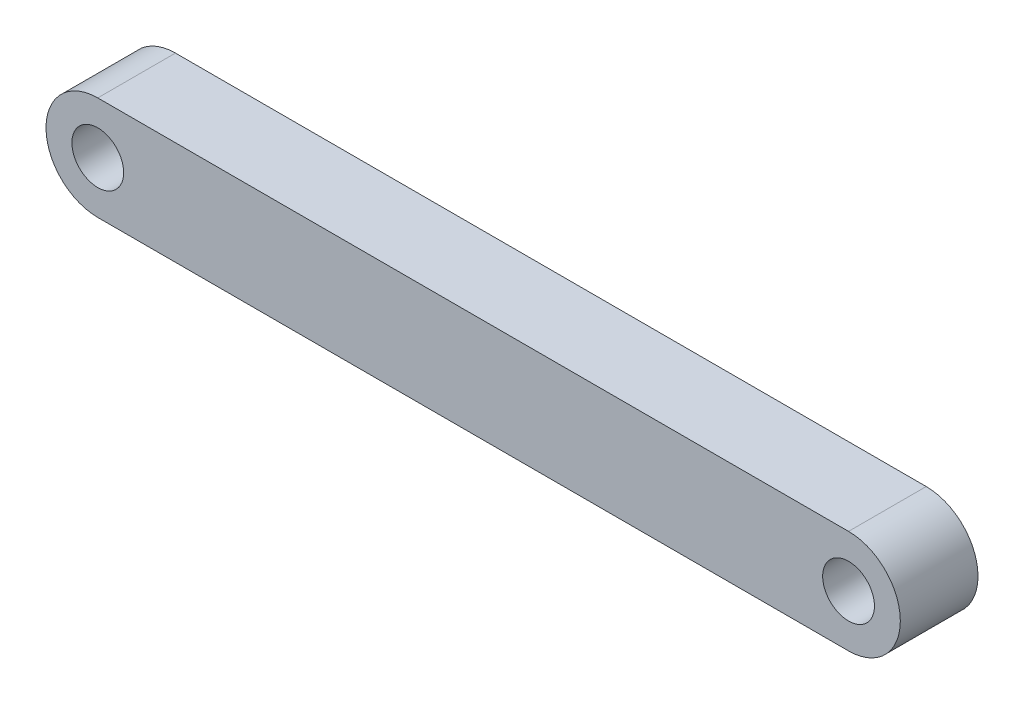
ISO-10303-21;
HEADER;
FILE_DESCRIPTION(('STEP AP214'),'2;1');
FILE_NAME('part.step','',(''),(''),'','','');
FILE_SCHEMA(('AUTOMOTIVE_DESIGN { 1 0 10303 214 1 1 1 1 }'));
ENDSEC;
DATA;
#1=APPLICATION_CONTEXT('core data for automotive mechanical design processes');
#2=APPLICATION_PROTOCOL_DEFINITION('international standard','automotive_design',2000,#1);
#3=PRODUCT_CONTEXT('',#1,'mechanical');
#4=PRODUCT('Part','Part','',(#3));
#5=PRODUCT_RELATED_PRODUCT_CATEGORY('part','',(#4));
#6=PRODUCT_DEFINITION_FORMATION('','',#4);
#7=PRODUCT_DEFINITION_CONTEXT('part definition',#1,'design');
#8=PRODUCT_DEFINITION('design','',#6,#7);
#9=PRODUCT_DEFINITION_SHAPE('','',#8);
#10=(LENGTH_UNIT() NAMED_UNIT(*) SI_UNIT(.MILLI.,.METRE.));
#11=(NAMED_UNIT(*) PLANE_ANGLE_UNIT() SI_UNIT($,.RADIAN.));
#12=(NAMED_UNIT(*) SI_UNIT($,.STERADIAN.) SOLID_ANGLE_UNIT());
#13=UNCERTAINTY_MEASURE_WITH_UNIT(LENGTH_MEASURE(1.E-05),#10,'distance_accuracy_value','');
#14=(GEOMETRIC_REPRESENTATION_CONTEXT(3) GLOBAL_UNCERTAINTY_ASSIGNED_CONTEXT((#13)) GLOBAL_UNIT_ASSIGNED_CONTEXT((#10,
#11,#12)) REPRESENTATION_CONTEXT('',''));
#15=CARTESIAN_POINT('',(0.,0.,0.));
#16=DIRECTION('',(0.,0.,1.));
#17=DIRECTION('',(1.,0.,0.));
#18=AXIS2_PLACEMENT_3D('',#15,#16,#17);
#19=CARTESIAN_POINT('',(0.,0.,15.));
#20=DIRECTION('',(0.,0.,-1.));
#21=DIRECTION('',(-1.,0.,0.));
#22=AXIS2_PLACEMENT_3D('',#19,#20,#21);
#23=PLANE('',#22);
#24=CARTESIAN_POINT('',(0.,0.,15.));
#25=DIRECTION('',(0.,0.,1.));
#26=DIRECTION('',(-1.,0.,0.));
#27=AXIS2_PLACEMENT_3D('',#24,#25,#26);
#28=CIRCLE('',#27,20.);
#29=CARTESIAN_POINT('',(0.,-20.,15.));
#30=VERTEX_POINT('',#29);
#31=CARTESIAN_POINT('',(0.,20.,15.));
#32=VERTEX_POINT('',#31);
#33=EDGE_CURVE('E87',#30,#32,#28,.T.);
#34=ORIENTED_EDGE('',*,*,#33,.T.);
#35=DIRECTION('',(-1.,0.,0.));
#36=VECTOR('',#35,1.);
#37=CARTESIAN_POINT('',(0.,20.,15.));
#38=LINE('',#37,#36);
#39=CARTESIAN_POINT('',(-290.,20.,15.));
#40=VERTEX_POINT('',#39);
#41=EDGE_CURVE('E82',#32,#40,#38,.T.);
#42=ORIENTED_EDGE('',*,*,#41,.T.);
#43=CARTESIAN_POINT('',(-290.,0.,15.));
#44=DIRECTION('',(0.,0.,1.));
#45=DIRECTION('',(-1.,0.,0.));
#46=AXIS2_PLACEMENT_3D('',#43,#44,#45);
#47=CIRCLE('',#46,20.);
#48=CARTESIAN_POINT('',(-290.,-20.,15.));
#49=VERTEX_POINT('',#48);
#50=EDGE_CURVE('E85',#40,#49,#47,.T.);
#51=ORIENTED_EDGE('',*,*,#50,.T.);
#52=DIRECTION('',(1.,0.,0.));
#53=VECTOR('',#52,1.);
#54=CARTESIAN_POINT('',(0.,-20.,15.));
#55=LINE('',#54,#53);
#56=EDGE_CURVE('E52',#49,#30,#55,.T.);
#57=ORIENTED_EDGE('',*,*,#56,.T.);
#58=EDGE_LOOP('',(#34,#42,#51,#57));
#59=FACE_BOUND('',#58,.T.);
#60=CARTESIAN_POINT('',(0.,0.,15.));
#61=DIRECTION('',(0.,0.,1.));
#62=DIRECTION('',(1.,0.,0.));
#63=AXIS2_PLACEMENT_3D('',#60,#61,#62);
#64=CIRCLE('',#63,10.);
#65=CARTESIAN_POINT('',(10.,0.,15.));
#66=VERTEX_POINT('',#65);
#67=EDGE_CURVE('E102',#66,#66,#64,.T.);
#68=ORIENTED_EDGE('',*,*,#67,.F.);
#69=EDGE_LOOP('',(#68));
#70=FACE_BOUND('',#69,.T.);
#71=CARTESIAN_POINT('',(-290.,0.,15.));
#72=DIRECTION('',(0.,0.,1.));
#73=DIRECTION('',(1.,0.,0.));
#74=AXIS2_PLACEMENT_3D('',#71,#72,#73);
#75=CIRCLE('',#74,10.);
#76=CARTESIAN_POINT('',(-280.,0.,15.));
#77=VERTEX_POINT('',#76);
#78=EDGE_CURVE('E117',#77,#77,#75,.T.);
#79=ORIENTED_EDGE('',*,*,#78,.F.);
#80=EDGE_LOOP('',(#79));
#81=FACE_BOUND('',#80,.T.);
#82=ADVANCED_FACE('F35',(#59,#70,#81),#23,.F.);
#83=CARTESIAN_POINT('',(0.,0.,-15.));
#84=DIRECTION('',(0.,0.,-1.));
#85=DIRECTION('',(-1.,0.,0.));
#86=AXIS2_PLACEMENT_3D('',#83,#84,#85);
#87=PLANE('',#86);
#88=CARTESIAN_POINT('',(0.,0.,-15.));
#89=DIRECTION('',(0.,0.,1.));
#90=DIRECTION('',(1.,0.,0.));
#91=AXIS2_PLACEMENT_3D('',#88,#89,#90);
#92=CIRCLE('',#91,10.);
#93=CARTESIAN_POINT('',(10.,0.,-15.));
#94=VERTEX_POINT('',#93);
#95=EDGE_CURVE('E114',#94,#94,#92,.T.);
#96=ORIENTED_EDGE('',*,*,#95,.T.);
#97=EDGE_LOOP('',(#96));
#98=FACE_BOUND('',#97,.T.);
#99=CARTESIAN_POINT('',(0.,0.,-15.));
#100=DIRECTION('',(0.,0.,1.));
#101=DIRECTION('',(-1.,0.,0.));
#102=AXIS2_PLACEMENT_3D('',#99,#100,#101);
#103=CIRCLE('',#102,20.);
#104=CARTESIAN_POINT('',(0.,-20.,-15.));
#105=VERTEX_POINT('',#104);
#106=CARTESIAN_POINT('',(0.,20.,-15.));
#107=VERTEX_POINT('',#106);
#108=EDGE_CURVE('E99',#105,#107,#103,.T.);
#109=ORIENTED_EDGE('',*,*,#108,.F.);
#110=DIRECTION('',(1.,0.,0.));
#111=VECTOR('',#110,1.);
#112=CARTESIAN_POINT('',(0.,-20.,-15.));
#113=LINE('',#112,#111);
#114=CARTESIAN_POINT('',(-290.,-20.,-15.));
#115=VERTEX_POINT('',#114);
#116=EDGE_CURVE('E75',#115,#105,#113,.T.);
#117=ORIENTED_EDGE('',*,*,#116,.F.);
#118=CARTESIAN_POINT('',(-290.,0.,-15.));
#119=DIRECTION('',(0.,0.,1.));
#120=DIRECTION('',(-1.,0.,0.));
#121=AXIS2_PLACEMENT_3D('',#118,#119,#120);
#122=CIRCLE('',#121,20.);
#123=CARTESIAN_POINT('',(-290.,20.,-15.));
#124=VERTEX_POINT('',#123);
#125=EDGE_CURVE('E69',#124,#115,#122,.T.);
#126=ORIENTED_EDGE('',*,*,#125,.F.);
#127=DIRECTION('',(-1.,0.,0.));
#128=VECTOR('',#127,1.);
#129=CARTESIAN_POINT('',(0.,20.,-15.));
#130=LINE('',#129,#128);
#131=EDGE_CURVE('E91',#107,#124,#130,.T.);
#132=ORIENTED_EDGE('',*,*,#131,.F.);
#133=EDGE_LOOP('',(#109,#117,#126,#132));
#134=FACE_BOUND('',#133,.T.);
#135=CARTESIAN_POINT('',(-290.,0.,-15.));
#136=DIRECTION('',(0.,0.,1.));
#137=DIRECTION('',(1.,0.,0.));
#138=AXIS2_PLACEMENT_3D('',#135,#136,#137);
#139=CIRCLE('',#138,10.);
#140=CARTESIAN_POINT('',(-280.,0.,-15.));
#141=VERTEX_POINT('',#140);
#142=EDGE_CURVE('E120',#141,#141,#139,.T.);
#143=ORIENTED_EDGE('',*,*,#142,.T.);
#144=EDGE_LOOP('',(#143));
#145=FACE_BOUND('',#144,.T.);
#146=ADVANCED_FACE('F110',(#98,#134,#145),#87,.T.);
#147=CARTESIAN_POINT('',(0.,0.,15.));
#148=DIRECTION('',(0.,0.,-1.));
#149=DIRECTION('',(-1.,0.,0.));
#150=AXIS2_PLACEMENT_3D('',#147,#148,#149);
#151=CYLINDRICAL_SURFACE('',#150,20.);
#152=ORIENTED_EDGE('',*,*,#108,.T.);
#153=DIRECTION('',(0.,0.,-1.));
#154=VECTOR('',#153,1.);
#155=CARTESIAN_POINT('',(0.,20.,15.));
#156=LINE('',#155,#154);
#157=EDGE_CURVE('E11',#32,#107,#156,.T.);
#158=ORIENTED_EDGE('',*,*,#157,.F.);
#159=ORIENTED_EDGE('',*,*,#33,.F.);
#160=DIRECTION('',(0.,0.,-1.));
#161=VECTOR('',#160,1.);
#162=CARTESIAN_POINT('',(0.,-20.,15.));
#163=LINE('',#162,#161);
#164=EDGE_CURVE('E95',#30,#105,#163,.T.);
#165=ORIENTED_EDGE('',*,*,#164,.T.);
#166=EDGE_LOOP('',(#152,#158,#159,#165));
#167=FACE_BOUND('',#166,.T.);
#168=ADVANCED_FACE('F37',(#167),#151,.T.);
#169=CARTESIAN_POINT('',(0.,20.,15.));
#170=DIRECTION('',(0.,-1.,0.));
#171=DIRECTION('',(1.,0.,0.));
#172=AXIS2_PLACEMENT_3D('',#169,#170,#171);
#173=PLANE('',#172);
#174=ORIENTED_EDGE('',*,*,#131,.T.);
#175=DIRECTION('',(0.,0.,-1.));
#176=VECTOR('',#175,1.);
#177=CARTESIAN_POINT('',(-290.,20.,15.));
#178=LINE('',#177,#176);
#179=EDGE_CURVE('E44',#40,#124,#178,.T.);
#180=ORIENTED_EDGE('',*,*,#179,.F.);
#181=ORIENTED_EDGE('',*,*,#41,.F.);
#182=ORIENTED_EDGE('',*,*,#157,.T.);
#183=EDGE_LOOP('',(#174,#180,#181,#182));
#184=FACE_BOUND('',#183,.T.);
#185=ADVANCED_FACE('F90',(#184),#173,.F.);
#186=CARTESIAN_POINT('',(-290.,0.,15.));
#187=DIRECTION('',(0.,0.,-1.));
#188=DIRECTION('',(-1.,0.,0.));
#189=AXIS2_PLACEMENT_3D('',#186,#187,#188);
#190=CYLINDRICAL_SURFACE('',#189,20.);
#191=ORIENTED_EDGE('',*,*,#125,.T.);
#192=DIRECTION('',(0.,0.,-1.));
#193=VECTOR('',#192,1.);
#194=CARTESIAN_POINT('',(-290.,-20.,15.));
#195=LINE('',#194,#193);
#196=EDGE_CURVE('E92',#49,#115,#195,.T.);
#197=ORIENTED_EDGE('',*,*,#196,.F.);
#198=ORIENTED_EDGE('',*,*,#50,.F.);
#199=ORIENTED_EDGE('',*,*,#179,.T.);
#200=EDGE_LOOP('',(#191,#197,#198,#199));
#201=FACE_BOUND('',#200,.T.);
#202=ADVANCED_FACE('F93',(#201),#190,.T.);
#203=CARTESIAN_POINT('',(0.,-20.,15.));
#204=DIRECTION('',(0.,1.,0.));
#205=DIRECTION('',(-1.,0.,0.));
#206=AXIS2_PLACEMENT_3D('',#203,#204,#205);
#207=PLANE('',#206);
#208=ORIENTED_EDGE('',*,*,#116,.T.);
#209=ORIENTED_EDGE('',*,*,#164,.F.);
#210=ORIENTED_EDGE('',*,*,#56,.F.);
#211=ORIENTED_EDGE('',*,*,#196,.T.);
#212=EDGE_LOOP('',(#208,#209,#210,#211));
#213=FACE_BOUND('',#212,.T.);
#214=ADVANCED_FACE('F107',(#213),#207,.F.);
#215=CARTESIAN_POINT('',(0.,0.,15.));
#216=DIRECTION('',(0.,0.,-1.));
#217=DIRECTION('',(-1.,0.,0.));
#218=AXIS2_PLACEMENT_3D('',#215,#216,#217);
#219=CYLINDRICAL_SURFACE('',#218,10.);
#220=ORIENTED_EDGE('',*,*,#67,.T.);
#221=EDGE_LOOP('',(#220));
#222=FACE_BOUND('',#221,.T.);
#223=ORIENTED_EDGE('',*,*,#95,.F.);
#224=EDGE_LOOP('',(#223));
#225=FACE_BOUND('',#224,.T.);
#226=ADVANCED_FACE('F137',(#222,#225),#219,.F.);
#227=CARTESIAN_POINT('',(-290.,0.,15.));
#228=DIRECTION('',(0.,0.,-1.));
#229=DIRECTION('',(-1.,0.,0.));
#230=AXIS2_PLACEMENT_3D('',#227,#228,#229);
#231=CYLINDRICAL_SURFACE('',#230,10.);
#232=ORIENTED_EDGE('',*,*,#78,.T.);
#233=EDGE_LOOP('',(#232));
#234=FACE_BOUND('',#233,.T.);
#235=ORIENTED_EDGE('',*,*,#142,.F.);
#236=EDGE_LOOP('',(#235));
#237=FACE_BOUND('',#236,.T.);
#238=ADVANCED_FACE('F126',(#234,#237),#231,.F.);
#239=CLOSED_SHELL('',(#82,#146,#168,#185,#202,#214,#226,#238));
#240=MANIFOLD_SOLID_BREP('B2',#239);
#241=ADVANCED_BREP_SHAPE_REPRESENTATION('',(#18,#240),#14);
#242=SHAPE_DEFINITION_REPRESENTATION(#9,#241);
ENDSEC;
END-ISO-10303-21;
